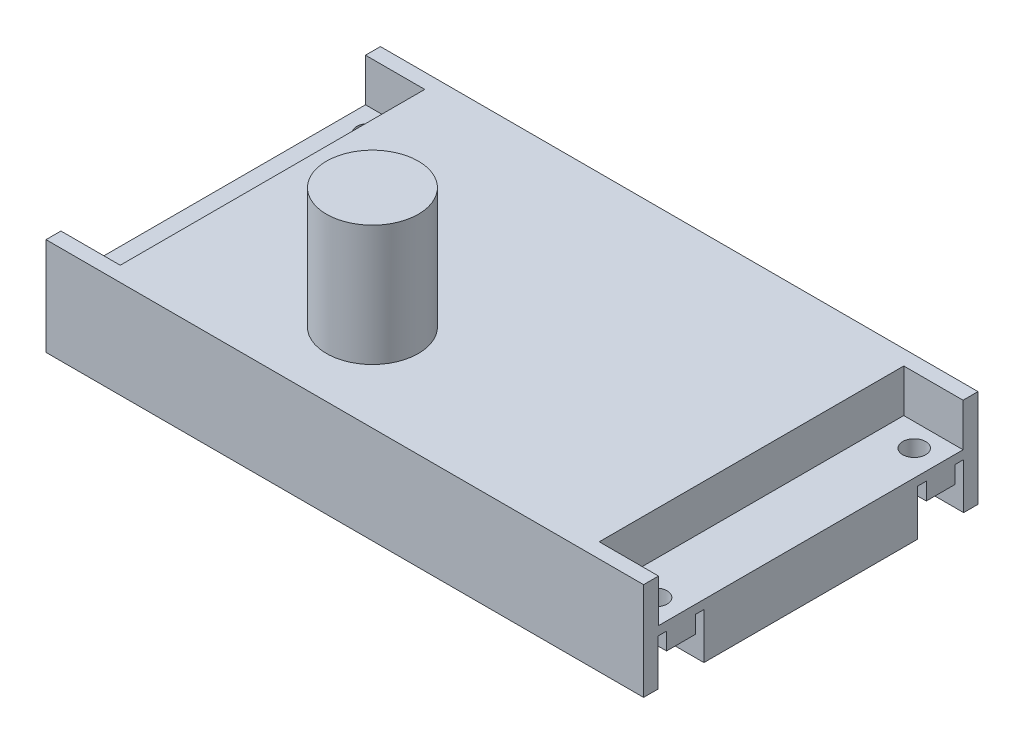
ISO-10303-21;
HEADER;
FILE_DESCRIPTION(('STEP AP214'),'2;1');
FILE_NAME('part.step','',(''),(''),'','','');
FILE_SCHEMA(('AUTOMOTIVE_DESIGN { 1 0 10303 214 1 1 1 1 }'));
ENDSEC;
DATA;
#1=APPLICATION_CONTEXT('core data for automotive mechanical design processes');
#2=APPLICATION_PROTOCOL_DEFINITION('international standard','automotive_design',2000,#1);
#3=PRODUCT_CONTEXT('',#1,'mechanical');
#4=PRODUCT('Part','Part','',(#3));
#5=PRODUCT_RELATED_PRODUCT_CATEGORY('part','',(#4));
#6=PRODUCT_DEFINITION_FORMATION('','',#4);
#7=PRODUCT_DEFINITION_CONTEXT('part definition',#1,'design');
#8=PRODUCT_DEFINITION('design','',#6,#7);
#9=PRODUCT_DEFINITION_SHAPE('','',#8);
#10=(LENGTH_UNIT() NAMED_UNIT(*) SI_UNIT(.MILLI.,.METRE.));
#11=(NAMED_UNIT(*) PLANE_ANGLE_UNIT() SI_UNIT($,.RADIAN.));
#12=(NAMED_UNIT(*) SI_UNIT($,.STERADIAN.) SOLID_ANGLE_UNIT());
#13=UNCERTAINTY_MEASURE_WITH_UNIT(LENGTH_MEASURE(1.E-05),#10,'distance_accuracy_value','');
#14=(GEOMETRIC_REPRESENTATION_CONTEXT(3) GLOBAL_UNCERTAINTY_ASSIGNED_CONTEXT((#13)) GLOBAL_UNIT_ASSIGNED_CONTEXT((#10,
#11,#12)) REPRESENTATION_CONTEXT('',''));
#15=CARTESIAN_POINT('',(0.,0.,0.));
#16=DIRECTION('',(0.,0.,1.));
#17=DIRECTION('',(1.,0.,0.));
#18=AXIS2_PLACEMENT_3D('',#15,#16,#17);
#19=CARTESIAN_POINT('',(0.,17.,0.));
#20=DIRECTION('',(1.,0.,0.));
#21=DIRECTION('',(0.,0.,-1.));
#22=AXIS2_PLACEMENT_3D('',#19,#20,#21);
#23=PLANE('',#22);
#24=DIRECTION('',(0.,-1.,0.));
#25=VECTOR('',#24,1.);
#26=CARTESIAN_POINT('',(2.79999995411728E-07,17.,-2.6));
#27=LINE('',#26,#25);
#28=CARTESIAN_POINT('',(2.79999995411728E-07,17.,-2.6));
#29=VERTEX_POINT('',#28);
#30=CARTESIAN_POINT('',(2.79999995411728E-07,9.525,-2.6));
#31=VERTEX_POINT('',#30);
#32=EDGE_CURVE('E805',#29,#31,#27,.T.);
#33=ORIENTED_EDGE('',*,*,#32,.T.);
#34=DIRECTION('',(0.,0.,-1.));
#35=VECTOR('',#34,1.);
#36=CARTESIAN_POINT('',(2.79999995411728E-07,9.525,-2.6));
#37=LINE('',#36,#35);
#38=CARTESIAN_POINT('',(2.79999995411728E-07,9.525,-55.6));
#39=VERTEX_POINT('',#38);
#40=EDGE_CURVE('E814',#31,#39,#37,.T.);
#41=ORIENTED_EDGE('',*,*,#40,.T.);
#42=DIRECTION('',(0.,1.,0.));
#43=VECTOR('',#42,1.);
#44=CARTESIAN_POINT('',(2.79999995411728E-07,17.,-55.6));
#45=LINE('',#44,#43);
#46=CARTESIAN_POINT('',(2.79999995411728E-07,17.,-55.6));
#47=VERTEX_POINT('',#46);
#48=EDGE_CURVE('E809',#39,#47,#45,.T.);
#49=ORIENTED_EDGE('',*,*,#48,.T.);
#50=DIRECTION('',(0.,0.,1.));
#51=VECTOR('',#50,1.);
#52=CARTESIAN_POINT('',(0.,17.,0.));
#53=LINE('',#52,#51);
#54=CARTESIAN_POINT('',(0.,17.,-58.2));
#55=VERTEX_POINT('',#54);
#56=EDGE_CURVE('E240',#55,#47,#53,.T.);
#57=ORIENTED_EDGE('',*,*,#56,.F.);
#58=DIRECTION('',(0.,-1.,0.));
#59=VECTOR('',#58,1.);
#60=CARTESIAN_POINT('',(0.,17.,-58.2));
#61=LINE('',#60,#59);
#62=CARTESIAN_POINT('',(0.,0.,-58.2));
#63=VERTEX_POINT('',#62);
#64=EDGE_CURVE('E422',#55,#63,#61,.T.);
#65=ORIENTED_EDGE('',*,*,#64,.T.);
#66=DIRECTION('',(0.,0.,1.));
#67=VECTOR('',#66,1.);
#68=CARTESIAN_POINT('',(0.,0.,0.));
#69=LINE('',#68,#67);
#70=CARTESIAN_POINT('',(0.,0.,-55.7));
#71=VERTEX_POINT('',#70);
#72=EDGE_CURVE('E423',#63,#71,#69,.T.);
#73=ORIENTED_EDGE('',*,*,#72,.T.);
#74=DIRECTION('',(0.,1.,0.));
#75=VECTOR('',#74,1.);
#76=CARTESIAN_POINT('',(0.,0.,-55.7));
#77=LINE('',#76,#75);
#78=CARTESIAN_POINT('',(0.,8.,-55.7));
#79=VERTEX_POINT('',#78);
#80=EDGE_CURVE('E303',#71,#79,#77,.T.);
#81=ORIENTED_EDGE('',*,*,#80,.T.);
#82=DIRECTION('',(0.,0.,1.));
#83=VECTOR('',#82,1.);
#84=CARTESIAN_POINT('',(0.,8.,-55.7));
#85=LINE('',#84,#83);
#86=CARTESIAN_POINT('',(0.,8.,-54.2));
#87=VERTEX_POINT('',#86);
#88=EDGE_CURVE('E306',#79,#87,#85,.T.);
#89=ORIENTED_EDGE('',*,*,#88,.T.);
#90=DIRECTION('',(0.,-1.,0.));
#91=VECTOR('',#90,1.);
#92=CARTESIAN_POINT('',(0.,8.,-54.2));
#93=LINE('',#92,#91);
#94=CARTESIAN_POINT('',(0.,5.,-54.2));
#95=VERTEX_POINT('',#94);
#96=EDGE_CURVE('E309',#87,#95,#93,.T.);
#97=ORIENTED_EDGE('',*,*,#96,.T.);
#98=DIRECTION('',(0.,0.,1.));
#99=VECTOR('',#98,1.);
#100=CARTESIAN_POINT('',(0.,5.,-54.2));
#101=LINE('',#100,#99);
#102=CARTESIAN_POINT('',(0.,5.,-49.2));
#103=VERTEX_POINT('',#102);
#104=EDGE_CURVE('E312',#95,#103,#101,.T.);
#105=ORIENTED_EDGE('',*,*,#104,.T.);
#106=DIRECTION('',(0.,1.,0.));
#107=VECTOR('',#106,1.);
#108=CARTESIAN_POINT('',(0.,5.,-49.2));
#109=LINE('',#108,#107);
#110=CARTESIAN_POINT('',(0.,8.,-49.2));
#111=VERTEX_POINT('',#110);
#112=EDGE_CURVE('E315',#103,#111,#109,.T.);
#113=ORIENTED_EDGE('',*,*,#112,.T.);
#114=DIRECTION('',(0.,0.,1.));
#115=VECTOR('',#114,1.);
#116=CARTESIAN_POINT('',(0.,8.,-49.2));
#117=LINE('',#116,#115);
#118=CARTESIAN_POINT('',(0.,8.,-47.7));
#119=VERTEX_POINT('',#118);
#120=EDGE_CURVE('E296',#111,#119,#117,.T.);
#121=ORIENTED_EDGE('',*,*,#120,.T.);
#122=DIRECTION('',(0.,-1.,0.));
#123=VECTOR('',#122,1.);
#124=CARTESIAN_POINT('',(0.,8.,-47.7));
#125=LINE('',#124,#123);
#126=CARTESIAN_POINT('',(0.,0.,-47.7));
#127=VERTEX_POINT('',#126);
#128=EDGE_CURVE('E299',#119,#127,#125,.T.);
#129=ORIENTED_EDGE('',*,*,#128,.T.);
#130=CARTESIAN_POINT('',(0.,0.,-10.5));
#131=VERTEX_POINT('',#130);
#132=EDGE_CURVE('E427',#127,#131,#69,.T.);
#133=ORIENTED_EDGE('',*,*,#132,.T.);
#134=DIRECTION('',(0.,1.,0.));
#135=VECTOR('',#134,1.);
#136=CARTESIAN_POINT('',(0.,8.,-10.5));
#137=LINE('',#136,#135);
#138=CARTESIAN_POINT('',(0.,8.,-10.5));
#139=VERTEX_POINT('',#138);
#140=EDGE_CURVE('E354',#131,#139,#137,.T.);
#141=ORIENTED_EDGE('',*,*,#140,.T.);
#142=DIRECTION('',(0.,0.,1.));
#143=VECTOR('',#142,1.);
#144=CARTESIAN_POINT('',(0.,8.,-9.));
#145=LINE('',#144,#143);
#146=CARTESIAN_POINT('',(0.,8.,-9.));
#147=VERTEX_POINT('',#146);
#148=EDGE_CURVE('E357',#139,#147,#145,.T.);
#149=ORIENTED_EDGE('',*,*,#148,.T.);
#150=DIRECTION('',(0.,-1.,0.));
#151=VECTOR('',#150,1.);
#152=CARTESIAN_POINT('',(0.,5.,-9.));
#153=LINE('',#152,#151);
#154=CARTESIAN_POINT('',(0.,5.,-9.));
#155=VERTEX_POINT('',#154);
#156=EDGE_CURVE('E361',#147,#155,#153,.T.);
#157=ORIENTED_EDGE('',*,*,#156,.T.);
#158=DIRECTION('',(0.,0.,1.));
#159=VECTOR('',#158,1.);
#160=CARTESIAN_POINT('',(0.,5.,-4.));
#161=LINE('',#160,#159);
#162=CARTESIAN_POINT('',(0.,5.,-4.));
#163=VERTEX_POINT('',#162);
#164=EDGE_CURVE('E364',#155,#163,#161,.T.);
#165=ORIENTED_EDGE('',*,*,#164,.T.);
#166=DIRECTION('',(0.,1.,0.));
#167=VECTOR('',#166,1.);
#168=CARTESIAN_POINT('',(0.,8.,-4.));
#169=LINE('',#168,#167);
#170=CARTESIAN_POINT('',(0.,8.,-4.));
#171=VERTEX_POINT('',#170);
#172=EDGE_CURVE('E367',#163,#171,#169,.T.);
#173=ORIENTED_EDGE('',*,*,#172,.T.);
#174=DIRECTION('',(0.,0.,1.));
#175=VECTOR('',#174,1.);
#176=CARTESIAN_POINT('',(0.,8.,-2.5));
#177=LINE('',#176,#175);
#178=CARTESIAN_POINT('',(0.,8.,-2.5));
#179=VERTEX_POINT('',#178);
#180=EDGE_CURVE('E370',#171,#179,#177,.T.);
#181=ORIENTED_EDGE('',*,*,#180,.T.);
#182=DIRECTION('',(0.,-1.,0.));
#183=VECTOR('',#182,1.);
#184=CARTESIAN_POINT('',(0.,0.,-2.5));
#185=LINE('',#184,#183);
#186=CARTESIAN_POINT('',(0.,0.,-2.5));
#187=VERTEX_POINT('',#186);
#188=EDGE_CURVE('E373',#179,#187,#185,.T.);
#189=ORIENTED_EDGE('',*,*,#188,.T.);
#190=CARTESIAN_POINT('',(0.,0.,0.));
#191=VERTEX_POINT('',#190);
#192=EDGE_CURVE('E398',#187,#191,#69,.T.);
#193=ORIENTED_EDGE('',*,*,#192,.T.);
#194=DIRECTION('',(0.,-1.,0.));
#195=VECTOR('',#194,1.);
#196=CARTESIAN_POINT('',(0.,17.,0.));
#197=LINE('',#196,#195);
#198=CARTESIAN_POINT('',(0.,17.,0.));
#199=VERTEX_POINT('',#198);
#200=EDGE_CURVE('E41',#199,#191,#197,.T.);
#201=ORIENTED_EDGE('',*,*,#200,.F.);
#202=EDGE_CURVE('E414',#29,#199,#53,.T.);
#203=ORIENTED_EDGE('',*,*,#202,.F.);
#204=EDGE_LOOP('',(#33,#41,#49,#57,#65,#73,#81,#89,#97,#105,#113,#121,#129,#133,#141,#149,#157,
#165,#173,#181,#189,#193,#201,#203));
#205=FACE_BOUND('',#204,.T.);
#206=ADVANCED_FACE('F33',(#205),#23,.F.);
#207=CARTESIAN_POINT('',(0.,17.,0.));
#208=DIRECTION('',(0.,-1.,0.));
#209=DIRECTION('',(0.,0.,-1.));
#210=AXIS2_PLACEMENT_3D('',#207,#208,#209);
#211=PLANE('',#210);
#212=CARTESIAN_POINT('',(41.5734853449635,17.,-15.236601424075));
#213=DIRECTION('',(0.,-1.,0.));
#214=DIRECTION('',(0.,0.,-1.));
#215=AXIS2_PLACEMENT_3D('',#212,#213,#214);
#216=CIRCLE('',#215,8.);
#217=CARTESIAN_POINT('',(41.5734853449635,17.,-23.236601424075));
#218=VERTEX_POINT('',#217);
#219=EDGE_CURVE('E11',#218,#218,#216,.F.);
#220=ORIENTED_EDGE('',*,*,#219,.F.);
#221=EDGE_LOOP('',(#220));
#222=FACE_BOUND('',#221,.T.);
#223=DIRECTION('',(-1.,0.,0.));
#224=VECTOR('',#223,1.);
#225=CARTESIAN_POINT('',(10.31875028,17.,-2.6));
#226=LINE('',#225,#224);
#227=CARTESIAN_POINT('',(10.31875028,17.,-2.6));
#228=VERTEX_POINT('',#227);
#229=EDGE_CURVE('E241',#228,#29,#226,.T.);
#230=ORIENTED_EDGE('',*,*,#229,.T.);
#231=ORIENTED_EDGE('',*,*,#202,.T.);
#232=DIRECTION('',(1.,0.,0.));
#233=VECTOR('',#232,1.);
#234=CARTESIAN_POINT('',(0.,17.,0.));
#235=LINE('',#234,#233);
#236=CARTESIAN_POINT('',(104.,17.,0.));
#237=VERTEX_POINT('',#236);
#238=EDGE_CURVE('E413',#199,#237,#235,.T.);
#239=ORIENTED_EDGE('',*,*,#238,.T.);
#240=DIRECTION('',(0.,0.,-1.));
#241=VECTOR('',#240,1.);
#242=CARTESIAN_POINT('',(104.,17.,0.));
#243=LINE('',#242,#241);
#244=CARTESIAN_POINT('',(104.,17.,-2.6));
#245=VERTEX_POINT('',#244);
#246=EDGE_CURVE('E417',#237,#245,#243,.T.);
#247=ORIENTED_EDGE('',*,*,#246,.T.);
#248=DIRECTION('',(1.,0.,0.));
#249=VECTOR('',#248,1.);
#250=CARTESIAN_POINT('',(93.68125,17.,-2.6));
#251=LINE('',#250,#249);
#252=CARTESIAN_POINT('',(93.68125,17.,-2.6));
#253=VERTEX_POINT('',#252);
#254=EDGE_CURVE('E268',#253,#245,#251,.T.);
#255=ORIENTED_EDGE('',*,*,#254,.F.);
#256=DIRECTION('',(0.,0.,1.));
#257=VECTOR('',#256,1.);
#258=CARTESIAN_POINT('',(93.68125,17.,-2.6));
#259=LINE('',#258,#257);
#260=CARTESIAN_POINT('',(93.68125,17.,-55.6));
#261=VERTEX_POINT('',#260);
#262=EDGE_CURVE('E259',#261,#253,#259,.T.);
#263=ORIENTED_EDGE('',*,*,#262,.F.);
#264=DIRECTION('',(1.,0.,0.));
#265=VECTOR('',#264,1.);
#266=CARTESIAN_POINT('',(93.68125,17.,-55.6));
#267=LINE('',#266,#265);
#268=CARTESIAN_POINT('',(104.,17.,-55.6));
#269=VERTEX_POINT('',#268);
#270=EDGE_CURVE('E271',#261,#269,#267,.T.);
#271=ORIENTED_EDGE('',*,*,#270,.T.);
#272=CARTESIAN_POINT('',(104.,17.,-58.2));
#273=VERTEX_POINT('',#272);
#274=EDGE_CURVE('E416',#269,#273,#243,.T.);
#275=ORIENTED_EDGE('',*,*,#274,.T.);
#276=DIRECTION('',(-1.,0.,0.));
#277=VECTOR('',#276,1.);
#278=CARTESIAN_POINT('',(0.,17.,-58.2));
#279=LINE('',#278,#277);
#280=EDGE_CURVE('E420',#273,#55,#279,.T.);
#281=ORIENTED_EDGE('',*,*,#280,.T.);
#282=ORIENTED_EDGE('',*,*,#56,.T.);
#283=DIRECTION('',(-1.,0.,0.));
#284=VECTOR('',#283,1.);
#285=CARTESIAN_POINT('',(10.31875028,17.,-55.6));
#286=LINE('',#285,#284);
#287=CARTESIAN_POINT('',(10.31875028,17.,-55.6));
#288=VERTEX_POINT('',#287);
#289=EDGE_CURVE('E226',#288,#47,#286,.T.);
#290=ORIENTED_EDGE('',*,*,#289,.F.);
#291=DIRECTION('',(0.,0.,1.));
#292=VECTOR('',#291,1.);
#293=CARTESIAN_POINT('',(10.31875028,17.,-2.6));
#294=LINE('',#293,#292);
#295=EDGE_CURVE('E230',#288,#228,#294,.T.);
#296=ORIENTED_EDGE('',*,*,#295,.T.);
#297=EDGE_LOOP('',(#230,#231,#239,#247,#255,#263,#271,#275,#281,#282,#290,#296));
#298=FACE_BOUND('',#297,.T.);
#299=ADVANCED_FACE('F238',(#222,#298),#211,.F.);
#300=CARTESIAN_POINT('',(4.5,5.00000000000001,-6.6));
#301=DIRECTION('',(0.,-1.,0.));
#302=DIRECTION('',(0.,0.,-1.));
#303=AXIS2_PLACEMENT_3D('',#300,#301,#302);
#304=CYLINDRICAL_SURFACE('',#303,2.);
#305=CARTESIAN_POINT('',(4.5,5.00000000000001,-6.6));
#306=DIRECTION('',(0.,-1.,0.));
#307=DIRECTION('',(0.,0.,-1.));
#308=AXIS2_PLACEMENT_3D('',#305,#306,#307);
#309=CIRCLE('',#308,2.);
#310=CARTESIAN_POINT('',(4.5,5.00000000000001,-8.6));
#311=VERTEX_POINT('',#310);
#312=EDGE_CURVE('E283',#311,#311,#309,.T.);
#313=ORIENTED_EDGE('',*,*,#312,.T.);
#314=EDGE_LOOP('',(#313));
#315=FACE_BOUND('',#314,.T.);
#316=CARTESIAN_POINT('',(4.5,9.525,-6.6));
#317=DIRECTION('',(0.,1.,0.));
#318=DIRECTION('',(0.,0.,1.));
#319=AXIS2_PLACEMENT_3D('',#316,#317,#318);
#320=CIRCLE('',#319,2.);
#321=CARTESIAN_POINT('',(4.5,9.525,-4.6));
#322=VERTEX_POINT('',#321);
#323=EDGE_CURVE('E248',#322,#322,#320,.F.);
#324=ORIENTED_EDGE('',*,*,#323,.F.);
#325=EDGE_LOOP('',(#324));
#326=FACE_BOUND('',#325,.T.);
#327=ADVANCED_FACE('F541',(#315,#326),#304,.F.);
#328=CARTESIAN_POINT('',(4.5,5.,-51.6));
#329=DIRECTION('',(0.,-1.,0.));
#330=DIRECTION('',(0.,0.,-1.));
#331=AXIS2_PLACEMENT_3D('',#328,#329,#330);
#332=CYLINDRICAL_SURFACE('',#331,2.);
#333=CARTESIAN_POINT('',(4.5,5.,-51.6));
#334=DIRECTION('',(0.,-1.,0.));
#335=DIRECTION('',(0.,0.,-1.));
#336=AXIS2_PLACEMENT_3D('',#333,#334,#335);
#337=CIRCLE('',#336,2.);
#338=CARTESIAN_POINT('',(4.5,5.,-53.6));
#339=VERTEX_POINT('',#338);
#340=EDGE_CURVE('E280',#339,#339,#337,.T.);
#341=ORIENTED_EDGE('',*,*,#340,.T.);
#342=EDGE_LOOP('',(#341));
#343=FACE_BOUND('',#342,.T.);
#344=CARTESIAN_POINT('',(4.5,9.525,-51.6));
#345=DIRECTION('',(0.,1.,0.));
#346=DIRECTION('',(0.,0.,1.));
#347=AXIS2_PLACEMENT_3D('',#344,#345,#346);
#348=CIRCLE('',#347,2.);
#349=CARTESIAN_POINT('',(4.5,9.525,-49.6));
#350=VERTEX_POINT('',#349);
#351=EDGE_CURVE('E36',#350,#350,#348,.F.);
#352=ORIENTED_EDGE('',*,*,#351,.F.);
#353=EDGE_LOOP('',(#352));
#354=FACE_BOUND('',#353,.T.);
#355=ADVANCED_FACE('F547',(#343,#354),#332,.F.);
#356=CARTESIAN_POINT('',(0.,0.,0.));
#357=DIRECTION('',(0.,-1.,0.));
#358=DIRECTION('',(0.,0.,-1.));
#359=AXIS2_PLACEMENT_3D('',#356,#357,#358);
#360=PLANE('',#359);
#361=DIRECTION('',(1.,0.,0.));
#362=VECTOR('',#361,1.);
#363=CARTESIAN_POINT('',(0.,0.,-55.7));
#364=LINE('',#363,#362);
#365=CARTESIAN_POINT('',(104.,0.,-55.7));
#366=VERTEX_POINT('',#365);
#367=EDGE_CURVE('E348',#71,#366,#364,.T.);
#368=ORIENTED_EDGE('',*,*,#367,.F.);
#369=ORIENTED_EDGE('',*,*,#72,.F.);
#370=DIRECTION('',(-1.,0.,0.));
#371=VECTOR('',#370,1.);
#372=CARTESIAN_POINT('',(0.,0.,-58.2));
#373=LINE('',#372,#371);
#374=CARTESIAN_POINT('',(104.,0.,-58.2));
#375=VERTEX_POINT('',#374);
#376=EDGE_CURVE('E433',#375,#63,#373,.T.);
#377=ORIENTED_EDGE('',*,*,#376,.F.);
#378=DIRECTION('',(0.,0.,-1.));
#379=VECTOR('',#378,1.);
#380=CARTESIAN_POINT('',(104.,0.,0.));
#381=LINE('',#380,#379);
#382=EDGE_CURVE('E429',#366,#375,#381,.T.);
#383=ORIENTED_EDGE('',*,*,#382,.F.);
#384=EDGE_LOOP('',(#368,#369,#377,#383));
#385=FACE_BOUND('',#384,.T.);
#386=ADVANCED_FACE('F501',(#385),#360,.T.);
#387=DIRECTION('',(1.,0.,0.));
#388=VECTOR('',#387,1.);
#389=CARTESIAN_POINT('',(0.,0.,-2.5));
#390=LINE('',#389,#388);
#391=CARTESIAN_POINT('',(104.,0.,-2.5));
#392=VERTEX_POINT('',#391);
#393=EDGE_CURVE('E395',#187,#392,#390,.T.);
#394=ORIENTED_EDGE('',*,*,#393,.T.);
#395=CARTESIAN_POINT('',(104.,0.,0.));
#396=VERTEX_POINT('',#395);
#397=EDGE_CURVE('E430',#396,#392,#381,.T.);
#398=ORIENTED_EDGE('',*,*,#397,.F.);
#399=DIRECTION('',(1.,0.,0.));
#400=VECTOR('',#399,1.);
#401=CARTESIAN_POINT('',(0.,0.,0.));
#402=LINE('',#401,#400);
#403=EDGE_CURVE('E426',#191,#396,#402,.T.);
#404=ORIENTED_EDGE('',*,*,#403,.F.);
#405=ORIENTED_EDGE('',*,*,#192,.F.);
#406=EDGE_LOOP('',(#394,#398,#404,#405));
#407=FACE_BOUND('',#406,.T.);
#408=ADVANCED_FACE('F556',(#407),#360,.T.);
#409=CARTESIAN_POINT('',(0.,17.,0.));
#410=DIRECTION('',(0.,0.,-1.));
#411=DIRECTION('',(-1.,0.,0.));
#412=AXIS2_PLACEMENT_3D('',#409,#410,#411);
#413=PLANE('',#412);
#414=ORIENTED_EDGE('',*,*,#403,.T.);
#415=DIRECTION('',(0.,-1.,0.));
#416=VECTOR('',#415,1.);
#417=CARTESIAN_POINT('',(104.,17.,0.));
#418=LINE('',#417,#416);
#419=EDGE_CURVE('E441',#237,#396,#418,.T.);
#420=ORIENTED_EDGE('',*,*,#419,.F.);
#421=ORIENTED_EDGE('',*,*,#238,.F.);
#422=ORIENTED_EDGE('',*,*,#200,.T.);
#423=EDGE_LOOP('',(#414,#420,#421,#422));
#424=FACE_BOUND('',#423,.T.);
#425=ADVANCED_FACE('F560',(#424),#413,.F.);
#426=CARTESIAN_POINT('',(104.,17.,0.));
#427=DIRECTION('',(-1.,0.,0.));
#428=DIRECTION('',(0.,0.,1.));
#429=AXIS2_PLACEMENT_3D('',#426,#427,#428);
#430=PLANE('',#429);
#431=DIRECTION('',(0.,0.,-1.));
#432=VECTOR('',#431,1.);
#433=CARTESIAN_POINT('',(104.,9.525,-2.6));
#434=LINE('',#433,#432);
#435=CARTESIAN_POINT('',(104.,9.525,-2.6));
#436=VERTEX_POINT('',#435);
#437=CARTESIAN_POINT('',(104.,9.525,-55.6));
#438=VERTEX_POINT('',#437);
#439=EDGE_CURVE('E264',#436,#438,#434,.T.);
#440=ORIENTED_EDGE('',*,*,#439,.F.);
#441=DIRECTION('',(0.,-1.,0.));
#442=VECTOR('',#441,1.);
#443=CARTESIAN_POINT('',(104.,17.,-2.6));
#444=LINE('',#443,#442);
#445=EDGE_CURVE('E251',#245,#436,#444,.T.);
#446=ORIENTED_EDGE('',*,*,#445,.F.);
#447=ORIENTED_EDGE('',*,*,#246,.F.);
#448=ORIENTED_EDGE('',*,*,#419,.T.);
#449=ORIENTED_EDGE('',*,*,#397,.T.);
#450=DIRECTION('',(0.,-1.,0.));
#451=VECTOR('',#450,1.);
#452=CARTESIAN_POINT('',(104.,0.,-2.5));
#453=LINE('',#452,#451);
#454=CARTESIAN_POINT('',(104.,8.,-2.5));
#455=VERTEX_POINT('',#454);
#456=EDGE_CURVE('E358',#455,#392,#453,.T.);
#457=ORIENTED_EDGE('',*,*,#456,.F.);
#458=DIRECTION('',(0.,0.,1.));
#459=VECTOR('',#458,1.);
#460=CARTESIAN_POINT('',(104.,8.,-2.5));
#461=LINE('',#460,#459);
#462=CARTESIAN_POINT('',(104.,8.,-4.));
#463=VERTEX_POINT('',#462);
#464=EDGE_CURVE('E391',#463,#455,#461,.T.);
#465=ORIENTED_EDGE('',*,*,#464,.F.);
#466=DIRECTION('',(0.,1.,0.));
#467=VECTOR('',#466,1.);
#468=CARTESIAN_POINT('',(104.,8.,-4.));
#469=LINE('',#468,#467);
#470=CARTESIAN_POINT('',(104.,5.,-4.));
#471=VERTEX_POINT('',#470);
#472=EDGE_CURVE('E388',#471,#463,#469,.T.);
#473=ORIENTED_EDGE('',*,*,#472,.F.);
#474=DIRECTION('',(0.,0.,1.));
#475=VECTOR('',#474,1.);
#476=CARTESIAN_POINT('',(104.,5.,-4.));
#477=LINE('',#476,#475);
#478=CARTESIAN_POINT('',(104.,5.,-9.));
#479=VERTEX_POINT('',#478);
#480=EDGE_CURVE('E385',#479,#471,#477,.T.);
#481=ORIENTED_EDGE('',*,*,#480,.F.);
#482=DIRECTION('',(0.,-1.,0.));
#483=VECTOR('',#482,1.);
#484=CARTESIAN_POINT('',(104.,5.,-9.));
#485=LINE('',#484,#483);
#486=CARTESIAN_POINT('',(104.,8.,-9.));
#487=VERTEX_POINT('',#486);
#488=EDGE_CURVE('E382',#487,#479,#485,.T.);
#489=ORIENTED_EDGE('',*,*,#488,.F.);
#490=DIRECTION('',(0.,0.,1.));
#491=VECTOR('',#490,1.);
#492=CARTESIAN_POINT('',(104.,8.,-9.));
#493=LINE('',#492,#491);
#494=CARTESIAN_POINT('',(104.,8.,-10.5));
#495=VERTEX_POINT('',#494);
#496=EDGE_CURVE('E379',#495,#487,#493,.T.);
#497=ORIENTED_EDGE('',*,*,#496,.F.);
#498=DIRECTION('',(0.,1.,0.));
#499=VECTOR('',#498,1.);
#500=CARTESIAN_POINT('',(104.,8.,-10.5));
#501=LINE('',#500,#499);
#502=CARTESIAN_POINT('',(104.,0.,-10.5));
#503=VERTEX_POINT('',#502);
#504=EDGE_CURVE('E339',#503,#495,#501,.T.);
#505=ORIENTED_EDGE('',*,*,#504,.F.);
#506=CARTESIAN_POINT('',(104.,0.,-47.7));
#507=VERTEX_POINT('',#506);
#508=EDGE_CURVE('E434',#503,#507,#381,.T.);
#509=ORIENTED_EDGE('',*,*,#508,.T.);
#510=DIRECTION('',(0.,-1.,0.));
#511=VECTOR('',#510,1.);
#512=CARTESIAN_POINT('',(104.,8.,-47.7));
#513=LINE('',#512,#511);
#514=CARTESIAN_POINT('',(104.,8.,-47.7));
#515=VERTEX_POINT('',#514);
#516=EDGE_CURVE('E321',#515,#507,#513,.T.);
#517=ORIENTED_EDGE('',*,*,#516,.F.);
#518=DIRECTION('',(0.,0.,1.));
#519=VECTOR('',#518,1.);
#520=CARTESIAN_POINT('',(104.,8.,-49.2));
#521=LINE('',#520,#519);
#522=CARTESIAN_POINT('',(104.,8.,-49.2));
#523=VERTEX_POINT('',#522);
#524=EDGE_CURVE('E295',#523,#515,#521,.T.);
#525=ORIENTED_EDGE('',*,*,#524,.F.);
#526=DIRECTION('',(0.,1.,0.));
#527=VECTOR('',#526,1.);
#528=CARTESIAN_POINT('',(104.,5.,-49.2));
#529=LINE('',#528,#527);
#530=CARTESIAN_POINT('',(104.,5.,-49.2));
#531=VERTEX_POINT('',#530);
#532=EDGE_CURVE('E300',#531,#523,#529,.T.);
#533=ORIENTED_EDGE('',*,*,#532,.F.);
#534=DIRECTION('',(0.,0.,1.));
#535=VECTOR('',#534,1.);
#536=CARTESIAN_POINT('',(104.,5.,-54.2));
#537=LINE('',#536,#535);
#538=CARTESIAN_POINT('',(104.,5.,-54.2));
#539=VERTEX_POINT('',#538);
#540=EDGE_CURVE('E332',#539,#531,#537,.T.);
#541=ORIENTED_EDGE('',*,*,#540,.F.);
#542=DIRECTION('',(0.,-1.,0.));
#543=VECTOR('',#542,1.);
#544=CARTESIAN_POINT('',(104.,8.,-54.2));
#545=LINE('',#544,#543);
#546=CARTESIAN_POINT('',(104.,8.,-54.2));
#547=VERTEX_POINT('',#546);
#548=EDGE_CURVE('E329',#547,#539,#545,.T.);
#549=ORIENTED_EDGE('',*,*,#548,.F.);
#550=DIRECTION('',(0.,0.,1.));
#551=VECTOR('',#550,1.);
#552=CARTESIAN_POINT('',(104.,8.,-55.7));
#553=LINE('',#552,#551);
#554=CARTESIAN_POINT('',(104.,8.,-55.7));
#555=VERTEX_POINT('',#554);
#556=EDGE_CURVE('E326',#555,#547,#553,.T.);
#557=ORIENTED_EDGE('',*,*,#556,.F.);
#558=DIRECTION('',(0.,1.,0.));
#559=VECTOR('',#558,1.);
#560=CARTESIAN_POINT('',(104.,0.,-55.7));
#561=LINE('',#560,#559);
#562=EDGE_CURVE('E323',#366,#555,#561,.T.);
#563=ORIENTED_EDGE('',*,*,#562,.F.);
#564=ORIENTED_EDGE('',*,*,#382,.T.);
#565=DIRECTION('',(0.,-1.,0.));
#566=VECTOR('',#565,1.);
#567=CARTESIAN_POINT('',(104.,17.,-58.2));
#568=LINE('',#567,#566);
#569=EDGE_CURVE('E438',#273,#375,#568,.T.);
#570=ORIENTED_EDGE('',*,*,#569,.F.);
#571=ORIENTED_EDGE('',*,*,#274,.F.);
#572=DIRECTION('',(0.,1.,0.));
#573=VECTOR('',#572,1.);
#574=CARTESIAN_POINT('',(104.,17.,-55.6));
#575=LINE('',#574,#573);
#576=EDGE_CURVE('E256',#438,#269,#575,.T.);
#577=ORIENTED_EDGE('',*,*,#576,.F.);
#578=EDGE_LOOP('',(#440,#446,#447,#448,#449,#457,#465,#473,#481,#489,#497,#505,#509,#517,#525,
#533,#541,#549,#557,#563,#564,#570,#571,#577));
#579=FACE_BOUND('',#578,.T.);
#580=ADVANCED_FACE('F482',(#579),#430,.F.);
#581=CARTESIAN_POINT('',(0.,17.,-58.2));
#582=DIRECTION('',(0.,0.,1.));
#583=DIRECTION('',(1.,0.,0.));
#584=AXIS2_PLACEMENT_3D('',#581,#582,#583);
#585=PLANE('',#584);
#586=ORIENTED_EDGE('',*,*,#376,.T.);
#587=ORIENTED_EDGE('',*,*,#64,.F.);
#588=ORIENTED_EDGE('',*,*,#280,.F.);
#589=ORIENTED_EDGE('',*,*,#569,.T.);
#590=EDGE_LOOP('',(#586,#587,#588,#589));
#591=FACE_BOUND('',#590,.T.);
#592=ADVANCED_FACE('F506',(#591),#585,.F.);
#593=DIRECTION('',(1.,0.,0.));
#594=VECTOR('',#593,1.);
#595=CARTESIAN_POINT('',(0.,0.,-47.7));
#596=LINE('',#595,#594);
#597=EDGE_CURVE('E350',#127,#507,#596,.T.);
#598=ORIENTED_EDGE('',*,*,#597,.T.);
#599=ORIENTED_EDGE('',*,*,#508,.F.);
#600=DIRECTION('',(1.,0.,0.));
#601=VECTOR('',#600,1.);
#602=CARTESIAN_POINT('',(0.,0.,-10.5));
#603=LINE('',#602,#601);
#604=EDGE_CURVE('E376',#131,#503,#603,.T.);
#605=ORIENTED_EDGE('',*,*,#604,.F.);
#606=ORIENTED_EDGE('',*,*,#132,.F.);
#607=EDGE_LOOP('',(#598,#599,#605,#606));
#608=FACE_BOUND('',#607,.T.);
#609=ADVANCED_FACE('F515',(#608),#360,.T.);
#610=CARTESIAN_POINT('',(0.,0.,-2.5));
#611=DIRECTION('',(0.,0.,1.));
#612=DIRECTION('',(1.,0.,0.));
#613=AXIS2_PLACEMENT_3D('',#610,#611,#612);
#614=PLANE('',#613);
#615=ORIENTED_EDGE('',*,*,#456,.T.);
#616=ORIENTED_EDGE('',*,*,#393,.F.);
#617=ORIENTED_EDGE('',*,*,#188,.F.);
#618=DIRECTION('',(1.,0.,0.));
#619=VECTOR('',#618,1.);
#620=CARTESIAN_POINT('',(0.,8.,-2.5));
#621=LINE('',#620,#619);
#622=EDGE_CURVE('E399',#179,#455,#621,.T.);
#623=ORIENTED_EDGE('',*,*,#622,.T.);
#624=EDGE_LOOP('',(#615,#616,#617,#623));
#625=FACE_BOUND('',#624,.T.);
#626=ADVANCED_FACE('F555',(#625),#614,.F.);
#627=CARTESIAN_POINT('',(0.,8.,-2.5));
#628=DIRECTION('',(0.,1.,0.));
#629=DIRECTION('',(0.,0.,1.));
#630=AXIS2_PLACEMENT_3D('',#627,#628,#629);
#631=PLANE('',#630);
#632=ORIENTED_EDGE('',*,*,#464,.T.);
#633=ORIENTED_EDGE('',*,*,#622,.F.);
#634=ORIENTED_EDGE('',*,*,#180,.F.);
#635=DIRECTION('',(1.,0.,0.));
#636=VECTOR('',#635,1.);
#637=CARTESIAN_POINT('',(0.,8.,-4.));
#638=LINE('',#637,#636);
#639=EDGE_CURVE('E401',#171,#463,#638,.T.);
#640=ORIENTED_EDGE('',*,*,#639,.T.);
#641=EDGE_LOOP('',(#632,#633,#634,#640));
#642=FACE_BOUND('',#641,.T.);
#643=ADVANCED_FACE('F582',(#642),#631,.F.);
#644=CARTESIAN_POINT('',(0.,8.,-4.));
#645=DIRECTION('',(0.,0.,-1.));
#646=DIRECTION('',(-1.,0.,0.));
#647=AXIS2_PLACEMENT_3D('',#644,#645,#646);
#648=PLANE('',#647);
#649=ORIENTED_EDGE('',*,*,#472,.T.);
#650=ORIENTED_EDGE('',*,*,#639,.F.);
#651=ORIENTED_EDGE('',*,*,#172,.F.);
#652=DIRECTION('',(1.,0.,0.));
#653=VECTOR('',#652,1.);
#654=CARTESIAN_POINT('',(0.,5.,-4.));
#655=LINE('',#654,#653);
#656=EDGE_CURVE('E403',#163,#471,#655,.T.);
#657=ORIENTED_EDGE('',*,*,#656,.T.);
#658=EDGE_LOOP('',(#649,#650,#651,#657));
#659=FACE_BOUND('',#658,.T.);
#660=ADVANCED_FACE('F588',(#659),#648,.F.);
#661=CARTESIAN_POINT('',(0.,5.,-4.));
#662=DIRECTION('',(0.,1.,0.));
#663=DIRECTION('',(0.,0.,1.));
#664=AXIS2_PLACEMENT_3D('',#661,#662,#663);
#665=PLANE('',#664);
#666=ORIENTED_EDGE('',*,*,#312,.F.);
#667=EDGE_LOOP('',(#666));
#668=FACE_BOUND('',#667,.T.);
#669=CARTESIAN_POINT('',(99.5,5.00000000000001,-6.6));
#670=DIRECTION('',(0.,-1.,0.));
#671=DIRECTION('',(0.,0.,-1.));
#672=AXIS2_PLACEMENT_3D('',#669,#670,#671);
#673=CIRCLE('',#672,2.);
#674=CARTESIAN_POINT('',(99.5,5.00000000000001,-8.6));
#675=VERTEX_POINT('',#674);
#676=EDGE_CURVE('E286',#675,#675,#673,.T.);
#677=ORIENTED_EDGE('',*,*,#676,.F.);
#678=EDGE_LOOP('',(#677));
#679=FACE_BOUND('',#678,.T.);
#680=ORIENTED_EDGE('',*,*,#480,.T.);
#681=ORIENTED_EDGE('',*,*,#656,.F.);
#682=ORIENTED_EDGE('',*,*,#164,.F.);
#683=DIRECTION('',(1.,0.,0.));
#684=VECTOR('',#683,1.);
#685=CARTESIAN_POINT('',(0.,5.,-9.));
#686=LINE('',#685,#684);
#687=EDGE_CURVE('E405',#155,#479,#686,.T.);
#688=ORIENTED_EDGE('',*,*,#687,.T.);
#689=EDGE_LOOP('',(#680,#681,#682,#688));
#690=FACE_BOUND('',#689,.T.);
#691=ADVANCED_FACE('F591',(#668,#679,#690),#665,.F.);
#692=CARTESIAN_POINT('',(0.,5.,-9.));
#693=DIRECTION('',(0.,0.,1.));
#694=DIRECTION('',(1.,0.,0.));
#695=AXIS2_PLACEMENT_3D('',#692,#693,#694);
#696=PLANE('',#695);
#697=ORIENTED_EDGE('',*,*,#488,.T.);
#698=ORIENTED_EDGE('',*,*,#687,.F.);
#699=ORIENTED_EDGE('',*,*,#156,.F.);
#700=DIRECTION('',(1.,0.,0.));
#701=VECTOR('',#700,1.);
#702=CARTESIAN_POINT('',(0.,8.,-9.));
#703=LINE('',#702,#701);
#704=EDGE_CURVE('E407',#147,#487,#703,.T.);
#705=ORIENTED_EDGE('',*,*,#704,.T.);
#706=EDGE_LOOP('',(#697,#698,#699,#705));
#707=FACE_BOUND('',#706,.T.);
#708=ADVANCED_FACE('F594',(#707),#696,.F.);
#709=CARTESIAN_POINT('',(0.,8.,-9.));
#710=DIRECTION('',(0.,1.,0.));
#711=DIRECTION('',(0.,0.,1.));
#712=AXIS2_PLACEMENT_3D('',#709,#710,#711);
#713=PLANE('',#712);
#714=ORIENTED_EDGE('',*,*,#496,.T.);
#715=ORIENTED_EDGE('',*,*,#704,.F.);
#716=ORIENTED_EDGE('',*,*,#148,.F.);
#717=DIRECTION('',(1.,0.,0.));
#718=VECTOR('',#717,1.);
#719=CARTESIAN_POINT('',(0.,8.,-10.5));
#720=LINE('',#719,#718);
#721=EDGE_CURVE('E409',#139,#495,#720,.T.);
#722=ORIENTED_EDGE('',*,*,#721,.T.);
#723=EDGE_LOOP('',(#714,#715,#716,#722));
#724=FACE_BOUND('',#723,.T.);
#725=ADVANCED_FACE('F531',(#724),#713,.F.);
#726=CARTESIAN_POINT('',(0.,8.,-10.5));
#727=DIRECTION('',(0.,0.,-1.));
#728=DIRECTION('',(0.,1.,0.));
#729=AXIS2_PLACEMENT_3D('',#726,#727,#728);
#730=PLANE('',#729);
#731=ORIENTED_EDGE('',*,*,#504,.T.);
#732=ORIENTED_EDGE('',*,*,#721,.F.);
#733=ORIENTED_EDGE('',*,*,#140,.F.);
#734=ORIENTED_EDGE('',*,*,#604,.T.);
#735=EDGE_LOOP('',(#731,#732,#733,#734));
#736=FACE_BOUND('',#735,.T.);
#737=ADVANCED_FACE('F524',(#736),#730,.F.);
#738=CARTESIAN_POINT('',(0.,8.,-49.2));
#739=DIRECTION('',(0.,1.,0.));
#740=DIRECTION('',(0.,0.,1.));
#741=AXIS2_PLACEMENT_3D('',#738,#739,#740);
#742=PLANE('',#741);
#743=ORIENTED_EDGE('',*,*,#524,.T.);
#744=DIRECTION('',(1.,0.,0.));
#745=VECTOR('',#744,1.);
#746=CARTESIAN_POINT('',(0.,8.,-47.7));
#747=LINE('',#746,#745);
#748=EDGE_CURVE('E318',#119,#515,#747,.T.);
#749=ORIENTED_EDGE('',*,*,#748,.F.);
#750=ORIENTED_EDGE('',*,*,#120,.F.);
#751=DIRECTION('',(1.,0.,0.));
#752=VECTOR('',#751,1.);
#753=CARTESIAN_POINT('',(0.,8.,-49.2));
#754=LINE('',#753,#752);
#755=EDGE_CURVE('E337',#111,#523,#754,.T.);
#756=ORIENTED_EDGE('',*,*,#755,.T.);
#757=EDGE_LOOP('',(#743,#749,#750,#756));
#758=FACE_BOUND('',#757,.T.);
#759=ADVANCED_FACE('F522',(#758),#742,.F.);
#760=CARTESIAN_POINT('',(0.,5.,-49.2));
#761=DIRECTION('',(0.,0.,-1.));
#762=DIRECTION('',(-1.,0.,0.));
#763=AXIS2_PLACEMENT_3D('',#760,#761,#762);
#764=PLANE('',#763);
#765=ORIENTED_EDGE('',*,*,#532,.T.);
#766=ORIENTED_EDGE('',*,*,#755,.F.);
#767=ORIENTED_EDGE('',*,*,#112,.F.);
#768=DIRECTION('',(1.,0.,0.));
#769=VECTOR('',#768,1.);
#770=CARTESIAN_POINT('',(0.,5.,-49.2));
#771=LINE('',#770,#769);
#772=EDGE_CURVE('E340',#103,#531,#771,.T.);
#773=ORIENTED_EDGE('',*,*,#772,.T.);
#774=EDGE_LOOP('',(#765,#766,#767,#773));
#775=FACE_BOUND('',#774,.T.);
#776=ADVANCED_FACE('F472',(#775),#764,.F.);
#777=CARTESIAN_POINT('',(0.,5.,-54.2));
#778=DIRECTION('',(0.,1.,0.));
#779=DIRECTION('',(0.,0.,1.));
#780=AXIS2_PLACEMENT_3D('',#777,#778,#779);
#781=PLANE('',#780);
#782=ORIENTED_EDGE('',*,*,#340,.F.);
#783=EDGE_LOOP('',(#782));
#784=FACE_BOUND('',#783,.T.);
#785=CARTESIAN_POINT('',(99.5,5.,-51.6));
#786=DIRECTION('',(0.,-1.,0.));
#787=DIRECTION('',(0.,0.,-1.));
#788=AXIS2_PLACEMENT_3D('',#785,#786,#787);
#789=CIRCLE('',#788,2.);
#790=CARTESIAN_POINT('',(99.5,5.,-53.6));
#791=VERTEX_POINT('',#790);
#792=EDGE_CURVE('E289',#791,#791,#789,.T.);
#793=ORIENTED_EDGE('',*,*,#792,.F.);
#794=EDGE_LOOP('',(#793));
#795=FACE_BOUND('',#794,.T.);
#796=ORIENTED_EDGE('',*,*,#540,.T.);
#797=ORIENTED_EDGE('',*,*,#772,.F.);
#798=ORIENTED_EDGE('',*,*,#104,.F.);
#799=DIRECTION('',(1.,0.,0.));
#800=VECTOR('',#799,1.);
#801=CARTESIAN_POINT('',(0.,5.,-54.2));
#802=LINE('',#801,#800);
#803=EDGE_CURVE('E342',#95,#539,#802,.T.);
#804=ORIENTED_EDGE('',*,*,#803,.T.);
#805=EDGE_LOOP('',(#796,#797,#798,#804));
#806=FACE_BOUND('',#805,.T.);
#807=ADVANCED_FACE('F468',(#784,#795,#806),#781,.F.);
#808=CARTESIAN_POINT('',(0.,8.,-54.2));
#809=DIRECTION('',(0.,0.,1.));
#810=DIRECTION('',(1.,0.,0.));
#811=AXIS2_PLACEMENT_3D('',#808,#809,#810);
#812=PLANE('',#811);
#813=ORIENTED_EDGE('',*,*,#548,.T.);
#814=ORIENTED_EDGE('',*,*,#803,.F.);
#815=ORIENTED_EDGE('',*,*,#96,.F.);
#816=DIRECTION('',(1.,0.,0.));
#817=VECTOR('',#816,1.);
#818=CARTESIAN_POINT('',(0.,8.,-54.2));
#819=LINE('',#818,#817);
#820=EDGE_CURVE('E344',#87,#547,#819,.T.);
#821=ORIENTED_EDGE('',*,*,#820,.T.);
#822=EDGE_LOOP('',(#813,#814,#815,#821));
#823=FACE_BOUND('',#822,.T.);
#824=ADVANCED_FACE('F471',(#823),#812,.F.);
#825=CARTESIAN_POINT('',(0.,8.,-55.7));
#826=DIRECTION('',(0.,1.,0.));
#827=DIRECTION('',(0.,0.,1.));
#828=AXIS2_PLACEMENT_3D('',#825,#826,#827);
#829=PLANE('',#828);
#830=ORIENTED_EDGE('',*,*,#556,.T.);
#831=ORIENTED_EDGE('',*,*,#820,.F.);
#832=ORIENTED_EDGE('',*,*,#88,.F.);
#833=DIRECTION('',(1.,0.,0.));
#834=VECTOR('',#833,1.);
#835=CARTESIAN_POINT('',(0.,8.,-55.7));
#836=LINE('',#835,#834);
#837=EDGE_CURVE('E346',#79,#555,#836,.T.);
#838=ORIENTED_EDGE('',*,*,#837,.T.);
#839=EDGE_LOOP('',(#830,#831,#832,#838));
#840=FACE_BOUND('',#839,.T.);
#841=ADVANCED_FACE('F495',(#840),#829,.F.);
#842=CARTESIAN_POINT('',(0.,0.,-55.7));
#843=DIRECTION('',(0.,0.,-1.));
#844=DIRECTION('',(-1.,0.,0.));
#845=AXIS2_PLACEMENT_3D('',#842,#843,#844);
#846=PLANE('',#845);
#847=ORIENTED_EDGE('',*,*,#562,.T.);
#848=ORIENTED_EDGE('',*,*,#837,.F.);
#849=ORIENTED_EDGE('',*,*,#80,.F.);
#850=ORIENTED_EDGE('',*,*,#367,.T.);
#851=EDGE_LOOP('',(#847,#848,#849,#850));
#852=FACE_BOUND('',#851,.T.);
#853=ADVANCED_FACE('F497',(#852),#846,.F.);
#854=CARTESIAN_POINT('',(0.,8.,-47.7));
#855=DIRECTION('',(0.,0.,1.));
#856=DIRECTION('',(1.,0.,0.));
#857=AXIS2_PLACEMENT_3D('',#854,#855,#856);
#858=PLANE('',#857);
#859=ORIENTED_EDGE('',*,*,#516,.T.);
#860=ORIENTED_EDGE('',*,*,#597,.F.);
#861=ORIENTED_EDGE('',*,*,#128,.F.);
#862=ORIENTED_EDGE('',*,*,#748,.T.);
#863=EDGE_LOOP('',(#859,#860,#861,#862));
#864=FACE_BOUND('',#863,.T.);
#865=ADVANCED_FACE('F519',(#864),#858,.F.);
#866=CARTESIAN_POINT('',(41.5734853449635,38.,-15.236601424075));
#867=DIRECTION('',(0.,-1.,0.));
#868=DIRECTION('',(0.,0.,-1.));
#869=AXIS2_PLACEMENT_3D('',#866,#867,#868);
#870=CYLINDRICAL_SURFACE('',#869,8.);
#871=CARTESIAN_POINT('',(41.5734853449635,38.,-15.236601424075));
#872=DIRECTION('',(0.,1.,0.));
#873=DIRECTION('',(0.,0.,1.));
#874=AXIS2_PLACEMENT_3D('',#871,#872,#873);
#875=CIRCLE('',#874,8.);
#876=CARTESIAN_POINT('',(41.5734853449635,38.,-7.236601424075));
#877=VERTEX_POINT('',#876);
#878=EDGE_CURVE('E292',#877,#877,#875,.T.);
#879=ORIENTED_EDGE('',*,*,#878,.F.);
#880=EDGE_LOOP('',(#879));
#881=FACE_BOUND('',#880,.T.);
#882=ORIENTED_EDGE('',*,*,#219,.T.);
#883=EDGE_LOOP('',(#882));
#884=FACE_BOUND('',#883,.T.);
#885=ADVANCED_FACE('F688',(#881,#884),#870,.T.);
#886=CARTESIAN_POINT('',(41.5734853449635,38.,-15.236601424075));
#887=DIRECTION('',(0.,1.,0.));
#888=DIRECTION('',(0.,0.,1.));
#889=AXIS2_PLACEMENT_3D('',#886,#887,#888);
#890=PLANE('',#889);
#891=ORIENTED_EDGE('',*,*,#878,.T.);
#892=EDGE_LOOP('',(#891));
#893=FACE_BOUND('',#892,.T.);
#894=ADVANCED_FACE('F464',(#893),#890,.T.);
#895=CARTESIAN_POINT('',(99.5,5.,-51.6));
#896=DIRECTION('',(0.,-1.,0.));
#897=DIRECTION('',(0.,0.,-1.));
#898=AXIS2_PLACEMENT_3D('',#895,#896,#897);
#899=CYLINDRICAL_SURFACE('',#898,1.99999999999999);
#900=CARTESIAN_POINT('',(99.5,9.525,-51.6));
#901=DIRECTION('',(0.,-1.,0.));
#902=DIRECTION('',(0.,0.,-1.));
#903=AXIS2_PLACEMENT_3D('',#900,#901,#902);
#904=CIRCLE('',#903,1.99999999999999);
#905=CARTESIAN_POINT('',(99.5,9.525,-53.6));
#906=VERTEX_POINT('',#905);
#907=EDGE_CURVE('E277',#906,#906,#904,.F.);
#908=ORIENTED_EDGE('',*,*,#907,.T.);
#909=EDGE_LOOP('',(#908));
#910=FACE_BOUND('',#909,.T.);
#911=ORIENTED_EDGE('',*,*,#792,.T.);
#912=EDGE_LOOP('',(#911));
#913=FACE_BOUND('',#912,.T.);
#914=ADVANCED_FACE('F461',(#910,#913),#899,.F.);
#915=CARTESIAN_POINT('',(99.5,5.00000000000001,-6.6));
#916=DIRECTION('',(0.,-1.,0.));
#917=DIRECTION('',(0.,0.,-1.));
#918=AXIS2_PLACEMENT_3D('',#915,#916,#917);
#919=CYLINDRICAL_SURFACE('',#918,1.99999999999999);
#920=CARTESIAN_POINT('',(99.5,9.525,-6.6));
#921=DIRECTION('',(0.,-1.,0.));
#922=DIRECTION('',(0.,0.,-1.));
#923=AXIS2_PLACEMENT_3D('',#920,#921,#922);
#924=CIRCLE('',#923,1.99999999999999);
#925=CARTESIAN_POINT('',(99.5,9.525,-8.6));
#926=VERTEX_POINT('',#925);
#927=EDGE_CURVE('E270',#926,#926,#924,.F.);
#928=ORIENTED_EDGE('',*,*,#927,.T.);
#929=EDGE_LOOP('',(#928));
#930=FACE_BOUND('',#929,.T.);
#931=ORIENTED_EDGE('',*,*,#676,.T.);
#932=EDGE_LOOP('',(#931));
#933=FACE_BOUND('',#932,.T.);
#934=ADVANCED_FACE('F448',(#930,#933),#919,.F.);
#935=CARTESIAN_POINT('',(93.68125,9.525,-2.6));
#936=DIRECTION('',(0.,-1.,0.));
#937=DIRECTION('',(0.,0.,-1.));
#938=AXIS2_PLACEMENT_3D('',#935,#936,#937);
#939=PLANE('',#938);
#940=ORIENTED_EDGE('',*,*,#927,.F.);
#941=EDGE_LOOP('',(#940));
#942=FACE_BOUND('',#941,.T.);
#943=ORIENTED_EDGE('',*,*,#439,.T.);
#944=DIRECTION('',(1.,0.,0.));
#945=VECTOR('',#944,1.);
#946=CARTESIAN_POINT('',(93.68125,9.525,-55.6));
#947=LINE('',#946,#945);
#948=CARTESIAN_POINT('',(93.68125,9.525,-55.6));
#949=VERTEX_POINT('',#948);
#950=EDGE_CURVE('E274',#949,#438,#947,.T.);
#951=ORIENTED_EDGE('',*,*,#950,.F.);
#952=DIRECTION('',(0.,0.,-1.));
#953=VECTOR('',#952,1.);
#954=CARTESIAN_POINT('',(93.68125,9.525,-2.6));
#955=LINE('',#954,#953);
#956=CARTESIAN_POINT('',(93.68125,9.525,-2.6));
#957=VERTEX_POINT('',#956);
#958=EDGE_CURVE('E255',#957,#949,#955,.T.);
#959=ORIENTED_EDGE('',*,*,#958,.F.);
#960=DIRECTION('',(1.,0.,0.));
#961=VECTOR('',#960,1.);
#962=CARTESIAN_POINT('',(93.68125,9.525,-2.6));
#963=LINE('',#962,#961);
#964=EDGE_CURVE('E261',#957,#436,#963,.T.);
#965=ORIENTED_EDGE('',*,*,#964,.T.);
#966=EDGE_LOOP('',(#943,#951,#959,#965));
#967=FACE_BOUND('',#966,.T.);
#968=ORIENTED_EDGE('',*,*,#907,.F.);
#969=EDGE_LOOP('',(#968));
#970=FACE_BOUND('',#969,.T.);
#971=ADVANCED_FACE('F451',(#942,#967,#970),#939,.F.);
#972=CARTESIAN_POINT('',(93.68125,17.,-2.6));
#973=DIRECTION('',(0.,0.,1.));
#974=DIRECTION('',(0.,-1.,0.));
#975=AXIS2_PLACEMENT_3D('',#972,#973,#974);
#976=PLANE('',#975);
#977=ORIENTED_EDGE('',*,*,#445,.T.);
#978=ORIENTED_EDGE('',*,*,#964,.F.);
#979=DIRECTION('',(0.,-1.,0.));
#980=VECTOR('',#979,1.);
#981=CARTESIAN_POINT('',(93.68125,17.,-2.6));
#982=LINE('',#981,#980);
#983=EDGE_CURVE('E252',#253,#957,#982,.T.);
#984=ORIENTED_EDGE('',*,*,#983,.F.);
#985=ORIENTED_EDGE('',*,*,#254,.T.);
#986=EDGE_LOOP('',(#977,#978,#984,#985));
#987=FACE_BOUND('',#986,.T.);
#988=ADVANCED_FACE('F454',(#987),#976,.F.);
#989=CARTESIAN_POINT('',(93.68125,17.,-55.6));
#990=DIRECTION('',(0.,0.,-1.));
#991=DIRECTION('',(-1.,0.,0.));
#992=AXIS2_PLACEMENT_3D('',#989,#990,#991);
#993=PLANE('',#992);
#994=ORIENTED_EDGE('',*,*,#576,.T.);
#995=ORIENTED_EDGE('',*,*,#270,.F.);
#996=DIRECTION('',(0.,1.,0.));
#997=VECTOR('',#996,1.);
#998=CARTESIAN_POINT('',(93.68125,17.,-55.6));
#999=LINE('',#998,#997);
#1000=EDGE_CURVE('E57',#949,#261,#999,.T.);
#1001=ORIENTED_EDGE('',*,*,#1000,.F.);
#1002=ORIENTED_EDGE('',*,*,#950,.T.);
#1003=EDGE_LOOP('',(#994,#995,#1001,#1002));
#1004=FACE_BOUND('',#1003,.T.);
#1005=ADVANCED_FACE('F753',(#1004),#993,.F.);
#1006=CARTESIAN_POINT('',(93.68125,0.,0.));
#1007=DIRECTION('',(1.,0.,0.));
#1008=DIRECTION('',(0.,0.,-1.));
#1009=AXIS2_PLACEMENT_3D('',#1006,#1007,#1008);
#1010=PLANE('',#1009);
#1011=ORIENTED_EDGE('',*,*,#983,.T.);
#1012=ORIENTED_EDGE('',*,*,#958,.T.);
#1013=ORIENTED_EDGE('',*,*,#1000,.T.);
#1014=ORIENTED_EDGE('',*,*,#262,.T.);
#1015=EDGE_LOOP('',(#1011,#1012,#1013,#1014));
#1016=FACE_BOUND('',#1015,.T.);
#1017=ADVANCED_FACE('F761',(#1016),#1010,.T.);
#1018=CARTESIAN_POINT('',(10.31875028,9.525,-2.6));
#1019=DIRECTION('',(0.,1.,0.));
#1020=DIRECTION('',(0.,0.,1.));
#1021=AXIS2_PLACEMENT_3D('',#1018,#1019,#1020);
#1022=PLANE('',#1021);
#1023=ORIENTED_EDGE('',*,*,#40,.F.);
#1024=DIRECTION('',(-1.,0.,0.));
#1025=VECTOR('',#1024,1.);
#1026=CARTESIAN_POINT('',(10.31875028,9.525,-2.6));
#1027=LINE('',#1026,#1025);
#1028=CARTESIAN_POINT('',(10.31875028,9.525,-2.6));
#1029=VERTEX_POINT('',#1028);
#1030=EDGE_CURVE('E243',#1029,#31,#1027,.T.);
#1031=ORIENTED_EDGE('',*,*,#1030,.F.);
#1032=DIRECTION('',(0.,0.,-1.));
#1033=VECTOR('',#1032,1.);
#1034=CARTESIAN_POINT('',(10.31875028,9.525,-2.6));
#1035=LINE('',#1034,#1033);
#1036=CARTESIAN_POINT('',(10.31875028,9.525,-55.6));
#1037=VERTEX_POINT('',#1036);
#1038=EDGE_CURVE('E229',#1029,#1037,#1035,.T.);
#1039=ORIENTED_EDGE('',*,*,#1038,.T.);
#1040=DIRECTION('',(-1.,0.,0.));
#1041=VECTOR('',#1040,1.);
#1042=CARTESIAN_POINT('',(10.31875028,9.525,-55.6));
#1043=LINE('',#1042,#1041);
#1044=EDGE_CURVE('E228',#1037,#39,#1043,.T.);
#1045=ORIENTED_EDGE('',*,*,#1044,.T.);
#1046=EDGE_LOOP('',(#1023,#1031,#1039,#1045));
#1047=FACE_BOUND('',#1046,.T.);
#1048=ORIENTED_EDGE('',*,*,#351,.T.);
#1049=EDGE_LOOP('',(#1048));
#1050=FACE_BOUND('',#1049,.T.);
#1051=ORIENTED_EDGE('',*,*,#323,.T.);
#1052=EDGE_LOOP('',(#1051));
#1053=FACE_BOUND('',#1052,.T.);
#1054=ADVANCED_FACE('F768',(#1047,#1050,#1053),#1022,.T.);
#1055=CARTESIAN_POINT('',(10.31875028,17.,-2.6));
#1056=DIRECTION('',(0.,0.,-1.));
#1057=DIRECTION('',(0.,1.,0.));
#1058=AXIS2_PLACEMENT_3D('',#1055,#1056,#1057);
#1059=PLANE('',#1058);
#1060=ORIENTED_EDGE('',*,*,#32,.F.);
#1061=ORIENTED_EDGE('',*,*,#229,.F.);
#1062=DIRECTION('',(0.,-1.,0.));
#1063=VECTOR('',#1062,1.);
#1064=CARTESIAN_POINT('',(10.31875028,17.,-2.6));
#1065=LINE('',#1064,#1063);
#1066=EDGE_CURVE('E49',#228,#1029,#1065,.T.);
#1067=ORIENTED_EDGE('',*,*,#1066,.T.);
#1068=ORIENTED_EDGE('',*,*,#1030,.T.);
#1069=EDGE_LOOP('',(#1060,#1061,#1067,#1068));
#1070=FACE_BOUND('',#1069,.T.);
#1071=ADVANCED_FACE('F774',(#1070),#1059,.T.);
#1072=CARTESIAN_POINT('',(10.31875028,17.,-55.6));
#1073=DIRECTION('',(0.,0.,1.));
#1074=DIRECTION('',(1.,0.,0.));
#1075=AXIS2_PLACEMENT_3D('',#1072,#1073,#1074);
#1076=PLANE('',#1075);
#1077=ORIENTED_EDGE('',*,*,#48,.F.);
#1078=ORIENTED_EDGE('',*,*,#1044,.F.);
#1079=DIRECTION('',(0.,1.,0.));
#1080=VECTOR('',#1079,1.);
#1081=CARTESIAN_POINT('',(10.31875028,17.,-55.6));
#1082=LINE('',#1081,#1080);
#1083=EDGE_CURVE('E222',#1037,#288,#1082,.T.);
#1084=ORIENTED_EDGE('',*,*,#1083,.T.);
#1085=ORIENTED_EDGE('',*,*,#289,.T.);
#1086=EDGE_LOOP('',(#1077,#1078,#1084,#1085));
#1087=FACE_BOUND('',#1086,.T.);
#1088=ADVANCED_FACE('F224',(#1087),#1076,.T.);
#1089=CARTESIAN_POINT('',(10.31875028,0.,0.));
#1090=DIRECTION('',(-1.,0.,0.));
#1091=DIRECTION('',(0.,0.,-1.));
#1092=AXIS2_PLACEMENT_3D('',#1089,#1090,#1091);
#1093=PLANE('',#1092);
#1094=ORIENTED_EDGE('',*,*,#1066,.F.);
#1095=ORIENTED_EDGE('',*,*,#295,.F.);
#1096=ORIENTED_EDGE('',*,*,#1083,.F.);
#1097=ORIENTED_EDGE('',*,*,#1038,.F.);
#1098=EDGE_LOOP('',(#1094,#1095,#1096,#1097));
#1099=FACE_BOUND('',#1098,.T.);
#1100=ADVANCED_FACE('F233',(#1099),#1093,.T.);
#1101=CLOSED_SHELL('',(#206,#299,#327,#355,#386,#408,#425,#580,#592,#609,#626,#643,#660,#691,
#708,#725,#737,#759,#776,#807,#824,#841,#853,#865,#885,#894,#914,#934,#971,#988,#1005,#1017,
#1054,#1071,#1088,#1100));
#1102=MANIFOLD_SOLID_BREP('B2',#1101);
#1103=ADVANCED_BREP_SHAPE_REPRESENTATION('',(#18,#1102),#14);
#1104=SHAPE_DEFINITION_REPRESENTATION(#9,#1103);
ENDSEC;
END-ISO-10303-21;
